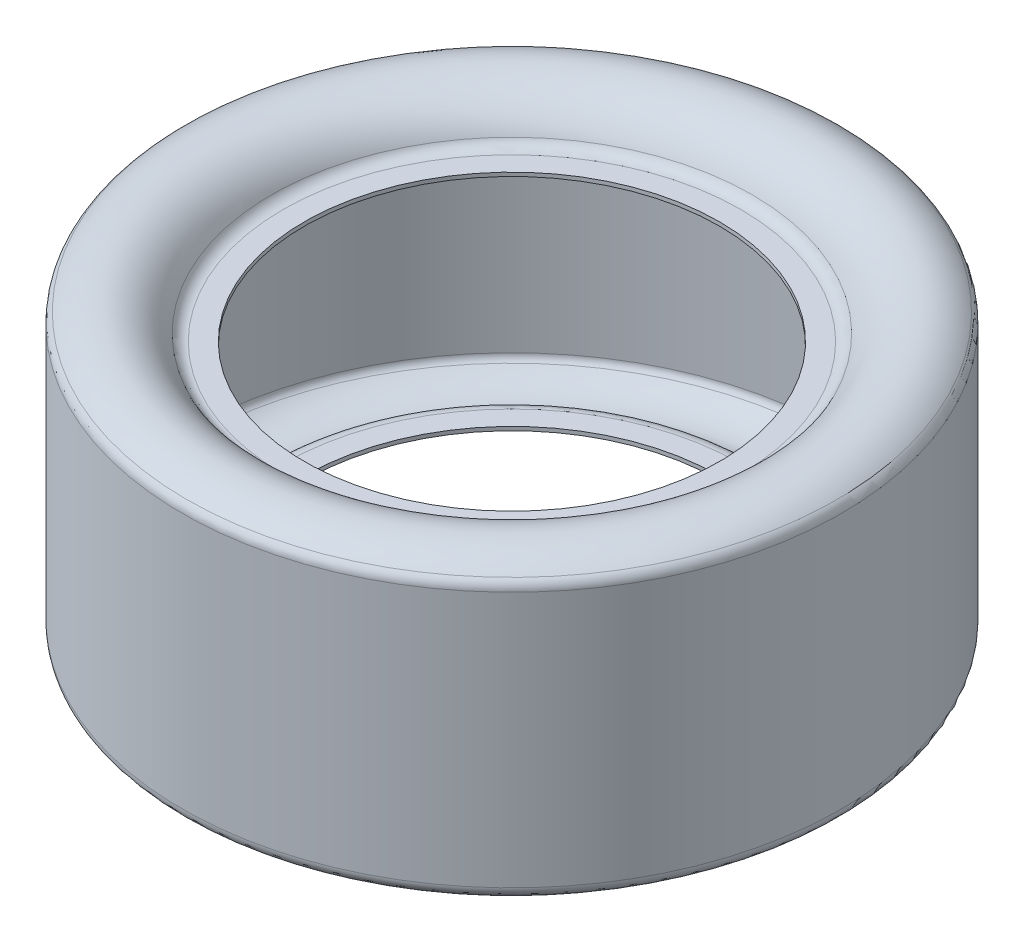
ISO-10303-21;
HEADER;
FILE_DESCRIPTION(('STEP AP214'),'2;1');
FILE_NAME('part.step','',(''),(''),'','','');
FILE_SCHEMA(('AUTOMOTIVE_DESIGN { 1 0 10303 214 1 1 1 1 }'));
ENDSEC;
DATA;
#1=APPLICATION_CONTEXT('core data for automotive mechanical design processes');
#2=APPLICATION_PROTOCOL_DEFINITION('international standard','automotive_design',2000,#1);
#3=PRODUCT_CONTEXT('',#1,'mechanical');
#4=PRODUCT('Part','Part','',(#3));
#5=PRODUCT_RELATED_PRODUCT_CATEGORY('part','',(#4));
#6=PRODUCT_DEFINITION_FORMATION('','',#4);
#7=PRODUCT_DEFINITION_CONTEXT('part definition',#1,'design');
#8=PRODUCT_DEFINITION('design','',#6,#7);
#9=PRODUCT_DEFINITION_SHAPE('','',#8);
#10=(LENGTH_UNIT() NAMED_UNIT(*) SI_UNIT(.MILLI.,.METRE.));
#11=(NAMED_UNIT(*) PLANE_ANGLE_UNIT() SI_UNIT($,.RADIAN.));
#12=(NAMED_UNIT(*) SI_UNIT($,.STERADIAN.) SOLID_ANGLE_UNIT());
#13=UNCERTAINTY_MEASURE_WITH_UNIT(LENGTH_MEASURE(1.E-05),#10,'distance_accuracy_value','');
#14=(GEOMETRIC_REPRESENTATION_CONTEXT(3) GLOBAL_UNCERTAINTY_ASSIGNED_CONTEXT((#13)) GLOBAL_UNIT_ASSIGNED_CONTEXT((#10,
#11,#12)) REPRESENTATION_CONTEXT('',''));
#15=CARTESIAN_POINT('',(0.,0.,0.));
#16=DIRECTION('',(0.,0.,1.));
#17=DIRECTION('',(1.,0.,0.));
#18=AXIS2_PLACEMENT_3D('',#15,#16,#17);
#19=CARTESIAN_POINT('',(0.,-50.8,0.));
#20=DIRECTION('',(0.,1.,0.));
#21=DIRECTION('',(0.,0.,-1.));
#22=AXIS2_PLACEMENT_3D('',#19,#20,#21);
#23=CYLINDRICAL_SURFACE('',#22,258.62);
#24=CARTESIAN_POINT('',(0.,-101.6,0.));
#25=DIRECTION('',(0.,-1.,0.));
#26=DIRECTION('',(0.,0.,-1.));
#27=AXIS2_PLACEMENT_3D('',#24,#25,#26);
#28=CIRCLE('',#27,258.62);
#29=CARTESIAN_POINT('',(0.,-101.6,-258.62));
#30=VERTEX_POINT('',#29);
#31=EDGE_CURVE('E261',#30,#30,#28,.F.);
#32=ORIENTED_EDGE('',*,*,#31,.F.);
#33=EDGE_LOOP('',(#32));
#34=FACE_BOUND('',#33,.T.);
#35=CARTESIAN_POINT('',(0.,101.6,0.));
#36=DIRECTION('',(0.,-1.,0.));
#37=DIRECTION('',(0.,0.,-1.));
#38=AXIS2_PLACEMENT_3D('',#35,#36,#37);
#39=CIRCLE('',#38,258.62);
#40=CARTESIAN_POINT('',(0.,101.6,-258.62));
#41=VERTEX_POINT('',#40);
#42=EDGE_CURVE('E258',#41,#41,#39,.T.);
#43=ORIENTED_EDGE('',*,*,#42,.F.);
#44=EDGE_LOOP('',(#43));
#45=FACE_BOUND('',#44,.T.);
#46=ADVANCED_FACE('F35',(#34,#45),#23,.F.);
#47=CARTESIAN_POINT('',(0.,-101.6,0.));
#48=DIRECTION('',(0.,1.,0.));
#49=DIRECTION('',(0.,0.,-1.));
#50=AXIS2_PLACEMENT_3D('',#47,#48,#49);
#51=TOROIDAL_SURFACE('',#50,251.62,6.9999999999999);
#52=ORIENTED_EDGE('',*,*,#31,.T.);
#53=EDGE_LOOP('',(#52));
#54=FACE_BOUND('',#53,.T.);
#55=CARTESIAN_POINT('',(0.,-106.98241227044,0.));
#56=DIRECTION('',(0.,-1.,0.));
#57=DIRECTION('',(0.,0.,-1.));
#58=AXIS2_PLACEMENT_3D('',#55,#56,#57);
#59=CIRCLE('',#58,256.095448374299);
#60=CARTESIAN_POINT('',(0.,-106.98241227044,-256.095448374299));
#61=VERTEX_POINT('',#60);
#62=EDGE_CURVE('E239',#61,#61,#59,.F.);
#63=ORIENTED_EDGE('',*,*,#62,.F.);
#64=EDGE_LOOP('',(#63));
#65=FACE_BOUND('',#64,.T.);
#66=ADVANCED_FACE('F252',(#54,#65),#51,.F.);
#67=CARTESIAN_POINT('',(0.,101.6,0.));
#68=DIRECTION('',(0.,1.,0.));
#69=DIRECTION('',(0.,0.,-1.));
#70=AXIS2_PLACEMENT_3D('',#67,#68,#69);
#71=TOROIDAL_SURFACE('',#70,251.62,6.9999999999999);
#72=CARTESIAN_POINT('',(0.,106.98241227044,0.));
#73=DIRECTION('',(0.,-1.,0.));
#74=DIRECTION('',(0.,0.,-1.));
#75=AXIS2_PLACEMENT_3D('',#72,#73,#74);
#76=CIRCLE('',#75,256.095448374299);
#77=CARTESIAN_POINT('',(0.,106.98241227044,-256.095448374299));
#78=VERTEX_POINT('',#77);
#79=EDGE_CURVE('E236',#78,#78,#76,.T.);
#80=ORIENTED_EDGE('',*,*,#79,.F.);
#81=EDGE_LOOP('',(#80));
#82=FACE_BOUND('',#81,.T.);
#83=ORIENTED_EDGE('',*,*,#42,.T.);
#84=EDGE_LOOP('',(#83));
#85=FACE_BOUND('',#84,.T.);
#86=ADVANCED_FACE('F248',(#82,#85),#71,.F.);
#87=CARTESIAN_POINT('',(0.,-75.7125833864919,0.));
#88=DIRECTION('',(0.,1.,0.));
#89=DIRECTION('',(0.,0.,-1.));
#90=AXIS2_PLACEMENT_3D('',#87,#88,#89);
#91=TOROIDAL_SURFACE('',#90,230.094745007174,40.667416613508);
#92=ORIENTED_EDGE('',*,*,#62,.T.);
#93=EDGE_LOOP('',(#92));
#94=FACE_BOUND('',#93,.T.);
#95=CARTESIAN_POINT('',(0.,-93.2832508625029,0.));
#96=DIRECTION('',(0.,-1.,0.));
#97=DIRECTION('',(0.,0.,-1.));
#98=AXIS2_PLACEMENT_3D('',#95,#96,#97);
#99=CIRCLE('',#98,193.418998000956);
#100=CARTESIAN_POINT('',(0.,-93.2832508625029,-193.418998000956));
#101=VERTEX_POINT('',#100);
#102=EDGE_CURVE('E200',#101,#101,#99,.T.);
#103=ORIENTED_EDGE('',*,*,#102,.T.);
#104=EDGE_LOOP('',(#103));
#105=FACE_BOUND('',#104,.T.);
#106=ADVANCED_FACE('F245',(#94,#105),#91,.F.);
#107=CARTESIAN_POINT('',(0.,75.712583386492,0.));
#108=DIRECTION('',(0.,1.,0.));
#109=DIRECTION('',(0.,0.,-1.));
#110=AXIS2_PLACEMENT_3D('',#107,#108,#109);
#111=TOROIDAL_SURFACE('',#110,230.094745007174,40.667416613508);
#112=CARTESIAN_POINT('',(0.,93.283250862503,0.));
#113=DIRECTION('',(0.,-1.,0.));
#114=DIRECTION('',(0.,0.,-1.));
#115=AXIS2_PLACEMENT_3D('',#112,#113,#114);
#116=CIRCLE('',#115,193.418998000956);
#117=CARTESIAN_POINT('',(0.,93.283250862503,-193.418998000956));
#118=VERTEX_POINT('',#117);
#119=EDGE_CURVE('E196',#118,#118,#116,.F.);
#120=ORIENTED_EDGE('',*,*,#119,.T.);
#121=EDGE_LOOP('',(#120));
#122=FACE_BOUND('',#121,.T.);
#123=ORIENTED_EDGE('',*,*,#79,.T.);
#124=EDGE_LOOP('',(#123));
#125=FACE_BOUND('',#124,.T.);
#126=ADVANCED_FACE('F220',(#122,#125),#111,.F.);
#127=CARTESIAN_POINT('',(0.,-98.9,0.));
#128=DIRECTION('',(0.,1.,0.));
#129=DIRECTION('',(0.,0.,-1.));
#130=AXIS2_PLACEMENT_3D('',#127,#128,#129);
#131=TOROIDAL_SURFACE('',#130,181.695,13.0000000000001);
#132=ORIENTED_EDGE('',*,*,#102,.F.);
#133=EDGE_LOOP('',(#132));
#134=FACE_BOUND('',#133,.T.);
#135=CARTESIAN_POINT('',(0.,-85.8999999999999,0.));
#136=DIRECTION('',(0.,-1.,0.));
#137=DIRECTION('',(0.,0.,1.));
#138=AXIS2_PLACEMENT_3D('',#135,#136,#137);
#139=CIRCLE('',#138,181.695000000036);
#140=CARTESIAN_POINT('',(0.,-85.8999999999999,181.695000000036));
#141=VERTEX_POINT('',#140);
#142=EDGE_CURVE('E199',#141,#141,#139,.T.);
#143=ORIENTED_EDGE('',*,*,#142,.T.);
#144=EDGE_LOOP('',(#143));
#145=FACE_BOUND('',#144,.T.);
#146=ADVANCED_FACE('F216',(#134,#145),#131,.T.);
#147=CARTESIAN_POINT('',(0.,98.9,0.));
#148=DIRECTION('',(0.,1.,0.));
#149=DIRECTION('',(0.,0.,-1.));
#150=AXIS2_PLACEMENT_3D('',#147,#148,#149);
#151=TOROIDAL_SURFACE('',#150,181.695,13.0000000000001);
#152=CARTESIAN_POINT('',(0.,85.8999999999999,0.));
#153=DIRECTION('',(0.,1.,0.));
#154=DIRECTION('',(0.,0.,1.));
#155=AXIS2_PLACEMENT_3D('',#152,#153,#154);
#156=CIRCLE('',#155,181.695000000036);
#157=CARTESIAN_POINT('',(0.,85.8999999999999,181.695000000036));
#158=VERTEX_POINT('',#157);
#159=EDGE_CURVE('E160',#158,#158,#156,.T.);
#160=ORIENTED_EDGE('',*,*,#159,.T.);
#161=EDGE_LOOP('',(#160));
#162=FACE_BOUND('',#161,.T.);
#163=ORIENTED_EDGE('',*,*,#119,.F.);
#164=EDGE_LOOP('',(#163));
#165=FACE_BOUND('',#164,.T.);
#166=ADVANCED_FACE('F182',(#162,#165),#151,.T.);
#167=CARTESIAN_POINT('',(0.,-85.8999999999999,164.825));
#168=DIRECTION('',(0.,1.,0.));
#169=DIRECTION('',(0.,0.,-1.));
#170=AXIS2_PLACEMENT_3D('',#167,#168,#169);
#171=PLANE('',#170);
#172=CARTESIAN_POINT('',(0.,-85.8999999999999,0.));
#173=DIRECTION('',(0.,-1.,0.));
#174=DIRECTION('',(0.,0.,-1.));
#175=AXIS2_PLACEMENT_3D('',#172,#173,#174);
#176=CIRCLE('',#175,164.825);
#177=CARTESIAN_POINT('',(0.,-85.8999999999999,-164.825));
#178=VERTEX_POINT('',#177);
#179=EDGE_CURVE('E38',#178,#178,#176,.F.);
#180=ORIENTED_EDGE('',*,*,#179,.F.);
#181=EDGE_LOOP('',(#180));
#182=FACE_BOUND('',#181,.T.);
#183=ORIENTED_EDGE('',*,*,#142,.F.);
#184=EDGE_LOOP('',(#183));
#185=FACE_BOUND('',#184,.T.);
#186=ADVANCED_FACE('F177',(#182,#185),#171,.T.);
#187=CARTESIAN_POINT('',(0.,85.9,181.695000000036));
#188=DIRECTION('',(0.,-1.,0.));
#189=DIRECTION('',(0.,0.,1.));
#190=AXIS2_PLACEMENT_3D('',#187,#188,#189);
#191=PLANE('',#190);
#192=CARTESIAN_POINT('',(0.,85.8999999999999,0.));
#193=DIRECTION('',(0.,-1.,0.));
#194=DIRECTION('',(0.,0.,-1.));
#195=AXIS2_PLACEMENT_3D('',#192,#193,#194);
#196=CIRCLE('',#195,164.825);
#197=CARTESIAN_POINT('',(0.,85.8999999999999,-164.825));
#198=VERTEX_POINT('',#197);
#199=EDGE_CURVE('E274',#198,#198,#196,.T.);
#200=ORIENTED_EDGE('',*,*,#199,.F.);
#201=EDGE_LOOP('',(#200));
#202=FACE_BOUND('',#201,.T.);
#203=ORIENTED_EDGE('',*,*,#159,.F.);
#204=EDGE_LOOP('',(#203));
#205=FACE_BOUND('',#204,.T.);
#206=ADVANCED_FACE('F167',(#202,#205),#191,.T.);
#207=CARTESIAN_POINT('',(0.,-87.3999999999999,0.));
#208=DIRECTION('',(0.,1.,0.));
#209=DIRECTION('',(0.,0.,-1.));
#210=AXIS2_PLACEMENT_3D('',#207,#208,#209);
#211=CYLINDRICAL_SURFACE('',#210,164.825);
#212=ORIENTED_EDGE('',*,*,#179,.T.);
#213=EDGE_LOOP('',(#212));
#214=FACE_BOUND('',#213,.T.);
#215=CARTESIAN_POINT('',(0.,-88.9,0.));
#216=DIRECTION('',(0.,-1.,0.));
#217=DIRECTION('',(0.,0.,-1.));
#218=AXIS2_PLACEMENT_3D('',#215,#216,#217);
#219=CIRCLE('',#218,164.825);
#220=CARTESIAN_POINT('',(0.,-88.9,-164.825));
#221=VERTEX_POINT('',#220);
#222=EDGE_CURVE('E272',#221,#221,#219,.T.);
#223=ORIENTED_EDGE('',*,*,#222,.T.);
#224=EDGE_LOOP('',(#223));
#225=FACE_BOUND('',#224,.T.);
#226=ADVANCED_FACE('F176',(#214,#225),#211,.F.);
#227=CARTESIAN_POINT('',(0.,87.3999999999999,0.));
#228=DIRECTION('',(0.,1.,0.));
#229=DIRECTION('',(0.,0.,-1.));
#230=AXIS2_PLACEMENT_3D('',#227,#228,#229);
#231=CYLINDRICAL_SURFACE('',#230,164.825);
#232=CARTESIAN_POINT('',(0.,88.9,0.));
#233=DIRECTION('',(0.,-1.,0.));
#234=DIRECTION('',(0.,0.,-1.));
#235=AXIS2_PLACEMENT_3D('',#232,#233,#234);
#236=CIRCLE('',#235,164.825);
#237=CARTESIAN_POINT('',(0.,88.9,-164.825));
#238=VERTEX_POINT('',#237);
#239=EDGE_CURVE('E269',#238,#238,#236,.F.);
#240=ORIENTED_EDGE('',*,*,#239,.T.);
#241=EDGE_LOOP('',(#240));
#242=FACE_BOUND('',#241,.T.);
#243=ORIENTED_EDGE('',*,*,#199,.T.);
#244=EDGE_LOOP('',(#243));
#245=FACE_BOUND('',#244,.T.);
#246=ADVANCED_FACE('F130',(#242,#245),#231,.F.);
#247=CARTESIAN_POINT('',(0.,-88.9,181.695));
#248=DIRECTION('',(0.,-1.,0.));
#249=DIRECTION('',(0.,0.,1.));
#250=AXIS2_PLACEMENT_3D('',#247,#248,#249);
#251=PLANE('',#250);
#252=ORIENTED_EDGE('',*,*,#222,.F.);
#253=EDGE_LOOP('',(#252));
#254=FACE_BOUND('',#253,.T.);
#255=CARTESIAN_POINT('',(0.,-88.9,0.));
#256=DIRECTION('',(0.,1.,0.));
#257=DIRECTION('',(0.,0.,1.));
#258=AXIS2_PLACEMENT_3D('',#255,#256,#257);
#259=CIRCLE('',#258,181.695);
#260=CARTESIAN_POINT('',(0.,-88.9,181.695));
#261=VERTEX_POINT('',#260);
#262=EDGE_CURVE('E147',#261,#261,#259,.T.);
#263=ORIENTED_EDGE('',*,*,#262,.F.);
#264=EDGE_LOOP('',(#263));
#265=FACE_BOUND('',#264,.T.);
#266=ADVANCED_FACE('F125',(#254,#265),#251,.T.);
#267=CARTESIAN_POINT('',(0.,88.9,164.825));
#268=DIRECTION('',(0.,1.,0.));
#269=DIRECTION('',(0.,0.,-1.));
#270=AXIS2_PLACEMENT_3D('',#267,#268,#269);
#271=PLANE('',#270);
#272=ORIENTED_EDGE('',*,*,#239,.F.);
#273=EDGE_LOOP('',(#272));
#274=FACE_BOUND('',#273,.T.);
#275=CARTESIAN_POINT('',(0.,88.9,0.));
#276=DIRECTION('',(0.,-1.,0.));
#277=DIRECTION('',(0.,0.,1.));
#278=AXIS2_PLACEMENT_3D('',#275,#276,#277);
#279=CIRCLE('',#278,181.695);
#280=CARTESIAN_POINT('',(0.,88.9,181.695));
#281=VERTEX_POINT('',#280);
#282=EDGE_CURVE('E112',#281,#281,#279,.T.);
#283=ORIENTED_EDGE('',*,*,#282,.F.);
#284=EDGE_LOOP('',(#283));
#285=FACE_BOUND('',#284,.T.);
#286=ADVANCED_FACE('F116',(#274,#285),#271,.T.);
#287=CARTESIAN_POINT('',(0.,-98.9,0.));
#288=DIRECTION('',(0.,1.,0.));
#289=DIRECTION('',(0.,0.,-1.));
#290=AXIS2_PLACEMENT_3D('',#287,#288,#289);
#291=TOROIDAL_SURFACE('',#290,181.695,10.);
#292=ORIENTED_EDGE('',*,*,#262,.T.);
#293=EDGE_LOOP('',(#292));
#294=FACE_BOUND('',#293,.T.);
#295=CARTESIAN_POINT('',(0.,-94.5794237403871,0.));
#296=DIRECTION('',(0.,-1.,0.));
#297=DIRECTION('',(0.,0.,-1.));
#298=AXIS2_PLACEMENT_3D('',#295,#296,#297);
#299=CIRCLE('',#298,190.713460000736);
#300=CARTESIAN_POINT('',(0.,-94.5794237403871,-190.713460000736));
#301=VERTEX_POINT('',#300);
#302=EDGE_CURVE('E83',#301,#301,#299,.T.);
#303=ORIENTED_EDGE('',*,*,#302,.T.);
#304=EDGE_LOOP('',(#303));
#305=FACE_BOUND('',#304,.T.);
#306=ADVANCED_FACE('F98',(#294,#305),#291,.F.);
#307=CARTESIAN_POINT('',(0.,98.9,0.));
#308=DIRECTION('',(0.,1.,0.));
#309=DIRECTION('',(0.,0.,-1.));
#310=AXIS2_PLACEMENT_3D('',#307,#308,#309);
#311=TOROIDAL_SURFACE('',#310,181.695,10.);
#312=CARTESIAN_POINT('',(0.,94.5794237403872,0.));
#313=DIRECTION('',(0.,-1.,0.));
#314=DIRECTION('',(0.,0.,-1.));
#315=AXIS2_PLACEMENT_3D('',#312,#313,#314);
#316=CIRCLE('',#315,190.713460000736);
#317=CARTESIAN_POINT('',(0.,94.5794237403872,-190.713460000736));
#318=VERTEX_POINT('',#317);
#319=EDGE_CURVE('E77',#318,#318,#316,.F.);
#320=ORIENTED_EDGE('',*,*,#319,.T.);
#321=EDGE_LOOP('',(#320));
#322=FACE_BOUND('',#321,.T.);
#323=ORIENTED_EDGE('',*,*,#282,.T.);
#324=EDGE_LOOP('',(#323));
#325=FACE_BOUND('',#324,.T.);
#326=ADVANCED_FACE('F92',(#322,#325),#311,.F.);
#327=CARTESIAN_POINT('',(0.,-75.7125833864919,0.));
#328=DIRECTION('',(0.,1.,0.));
#329=DIRECTION('',(0.,0.,-1.));
#330=AXIS2_PLACEMENT_3D('',#327,#328,#329);
#331=TOROIDAL_SURFACE('',#330,230.094745007174,43.667416613508);
#332=ORIENTED_EDGE('',*,*,#302,.F.);
#333=EDGE_LOOP('',(#332));
#334=FACE_BOUND('',#333,.T.);
#335=CARTESIAN_POINT('',(0.,-109.289160386343,0.));
#336=DIRECTION('',(0.,-1.,0.));
#337=DIRECTION('',(0.,0.,-1.));
#338=AXIS2_PLACEMENT_3D('',#335,#336,#337);
#339=CIRCLE('',#338,258.01349767757);
#340=CARTESIAN_POINT('',(0.,-109.289160386343,-258.01349767757));
#341=VERTEX_POINT('',#340);
#342=EDGE_CURVE('E74',#341,#341,#339,.T.);
#343=ORIENTED_EDGE('',*,*,#342,.T.);
#344=EDGE_LOOP('',(#343));
#345=FACE_BOUND('',#344,.T.);
#346=ADVANCED_FACE('F89',(#334,#345),#331,.T.);
#347=CARTESIAN_POINT('',(0.,75.712583386492,0.));
#348=DIRECTION('',(0.,1.,0.));
#349=DIRECTION('',(0.,0.,-1.));
#350=AXIS2_PLACEMENT_3D('',#347,#348,#349);
#351=TOROIDAL_SURFACE('',#350,230.094745007174,43.667416613508);
#352=CARTESIAN_POINT('',(0.,109.289160386343,0.));
#353=DIRECTION('',(0.,-1.,0.));
#354=DIRECTION('',(0.,0.,-1.));
#355=AXIS2_PLACEMENT_3D('',#352,#353,#354);
#356=CIRCLE('',#355,258.01349767757);
#357=CARTESIAN_POINT('',(0.,109.289160386343,-258.01349767757));
#358=VERTEX_POINT('',#357);
#359=EDGE_CURVE('E47',#358,#358,#356,.F.);
#360=ORIENTED_EDGE('',*,*,#359,.T.);
#361=EDGE_LOOP('',(#360));
#362=FACE_BOUND('',#361,.T.);
#363=ORIENTED_EDGE('',*,*,#319,.F.);
#364=EDGE_LOOP('',(#363));
#365=FACE_BOUND('',#364,.T.);
#366=ADVANCED_FACE('F67',(#362,#365),#351,.T.);
#367=CARTESIAN_POINT('',(0.,-101.6,0.));
#368=DIRECTION('',(0.,1.,0.));
#369=DIRECTION('',(0.,0.,-1.));
#370=AXIS2_PLACEMENT_3D('',#367,#368,#369);
#371=TOROIDAL_SURFACE('',#370,251.62,10.);
#372=ORIENTED_EDGE('',*,*,#342,.F.);
#373=EDGE_LOOP('',(#372));
#374=FACE_BOUND('',#373,.T.);
#375=CARTESIAN_POINT('',(0.,-101.6,0.));
#376=DIRECTION('',(0.,-1.,0.));
#377=DIRECTION('',(0.,0.,-1.));
#378=AXIS2_PLACEMENT_3D('',#375,#376,#377);
#379=CIRCLE('',#378,261.62);
#380=CARTESIAN_POINT('',(0.,-101.6,-261.62));
#381=VERTEX_POINT('',#380);
#382=EDGE_CURVE('E42',#381,#381,#379,.T.);
#383=ORIENTED_EDGE('',*,*,#382,.T.);
#384=EDGE_LOOP('',(#383));
#385=FACE_BOUND('',#384,.T.);
#386=ADVANCED_FACE('F63',(#374,#385),#371,.T.);
#387=CARTESIAN_POINT('',(0.,101.6,0.));
#388=DIRECTION('',(0.,1.,0.));
#389=DIRECTION('',(0.,0.,-1.));
#390=AXIS2_PLACEMENT_3D('',#387,#388,#389);
#391=TOROIDAL_SURFACE('',#390,251.62,10.);
#392=CARTESIAN_POINT('',(0.,101.6,0.));
#393=DIRECTION('',(0.,-1.,0.));
#394=DIRECTION('',(0.,0.,-1.));
#395=AXIS2_PLACEMENT_3D('',#392,#393,#394);
#396=CIRCLE('',#395,261.62);
#397=CARTESIAN_POINT('',(0.,101.6,-261.62));
#398=VERTEX_POINT('',#397);
#399=EDGE_CURVE('E10',#398,#398,#396,.F.);
#400=ORIENTED_EDGE('',*,*,#399,.T.);
#401=EDGE_LOOP('',(#400));
#402=FACE_BOUND('',#401,.T.);
#403=ORIENTED_EDGE('',*,*,#359,.F.);
#404=EDGE_LOOP('',(#403));
#405=FACE_BOUND('',#404,.T.);
#406=ADVANCED_FACE('F58',(#402,#405),#391,.T.);
#407=CARTESIAN_POINT('',(0.,50.8,0.));
#408=DIRECTION('',(0.,1.,0.));
#409=DIRECTION('',(0.,0.,-1.));
#410=AXIS2_PLACEMENT_3D('',#407,#408,#409);
#411=CYLINDRICAL_SURFACE('',#410,261.62);
#412=ORIENTED_EDGE('',*,*,#399,.F.);
#413=EDGE_LOOP('',(#412));
#414=FACE_BOUND('',#413,.T.);
#415=ORIENTED_EDGE('',*,*,#382,.F.);
#416=EDGE_LOOP('',(#415));
#417=FACE_BOUND('',#416,.T.);
#418=ADVANCED_FACE('F62',(#414,#417),#411,.T.);
#419=CLOSED_SHELL('',(#46,#66,#86,#106,#126,#146,#166,#186,#206,#226,#246,#266,#286,#306,#326,
#346,#366,#386,#406,#418));
#420=MANIFOLD_SOLID_BREP('B2',#419);
#421=ADVANCED_BREP_SHAPE_REPRESENTATION('',(#18,#420),#14);
#422=SHAPE_DEFINITION_REPRESENTATION(#9,#421);
ENDSEC;
END-ISO-10303-21;
